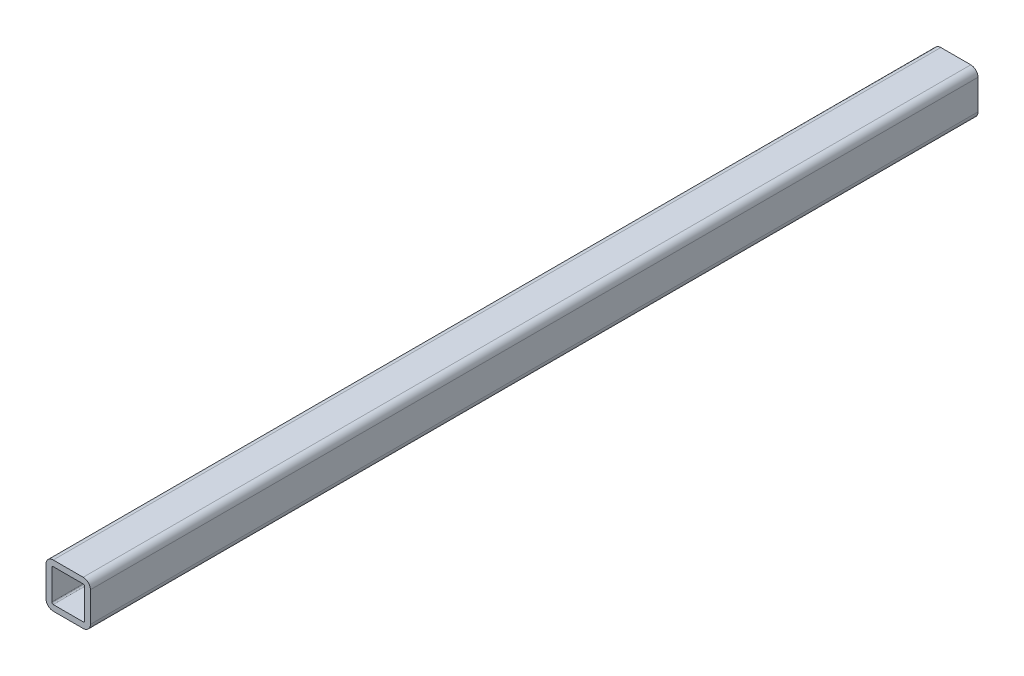
ISO-10303-21;
HEADER;
FILE_DESCRIPTION(('STEP AP214'),'2;1');
FILE_NAME('part.step','',(''),(''),'','','');
FILE_SCHEMA(('AUTOMOTIVE_DESIGN { 1 0 10303 214 1 1 1 1 }'));
ENDSEC;
DATA;
#1=APPLICATION_CONTEXT('core data for automotive mechanical design processes');
#2=APPLICATION_PROTOCOL_DEFINITION('international standard','automotive_design',2000,#1);
#3=PRODUCT_CONTEXT('',#1,'mechanical');
#4=PRODUCT('Part','Part','',(#3));
#5=PRODUCT_RELATED_PRODUCT_CATEGORY('part','',(#4));
#6=PRODUCT_DEFINITION_FORMATION('','',#4);
#7=PRODUCT_DEFINITION_CONTEXT('part definition',#1,'design');
#8=PRODUCT_DEFINITION('design','',#6,#7);
#9=PRODUCT_DEFINITION_SHAPE('','',#8);
#10=(LENGTH_UNIT() NAMED_UNIT(*) SI_UNIT(.MILLI.,.METRE.));
#11=(NAMED_UNIT(*) PLANE_ANGLE_UNIT() SI_UNIT($,.RADIAN.));
#12=(NAMED_UNIT(*) SI_UNIT($,.STERADIAN.) SOLID_ANGLE_UNIT());
#13=UNCERTAINTY_MEASURE_WITH_UNIT(LENGTH_MEASURE(1.E-05),#10,'distance_accuracy_value','');
#14=(GEOMETRIC_REPRESENTATION_CONTEXT(3) GLOBAL_UNCERTAINTY_ASSIGNED_CONTEXT((#13)) GLOBAL_UNIT_ASSIGNED_CONTEXT((#10,
#11,#12)) REPRESENTATION_CONTEXT('',''));
#15=CARTESIAN_POINT('',(0.,0.,0.));
#16=DIRECTION('',(0.,0.,1.));
#17=DIRECTION('',(1.,0.,0.));
#18=AXIS2_PLACEMENT_3D('',#15,#16,#17);
#19=CARTESIAN_POINT('',(4.28625000000001,-4.28625000000001,127.));
#20=DIRECTION('',(0.,0.,1.));
#21=DIRECTION('',(1.,0.,0.));
#22=AXIS2_PLACEMENT_3D('',#19,#20,#21);
#23=PLANE('',#22);
#24=CARTESIAN_POINT('',(4.28625000000001,-4.28625000000001,127.));
#25=DIRECTION('',(0.,0.,1.));
#26=DIRECTION('',(1.,0.,0.));
#27=AXIS2_PLACEMENT_3D('',#24,#25,#26);
#28=CIRCLE('',#27,2.06375);
#29=CARTESIAN_POINT('',(4.28625000000001,-6.35000000000001,127.));
#30=VERTEX_POINT('',#29);
#31=CARTESIAN_POINT('',(6.35000000000001,-4.28625000000001,127.));
#32=VERTEX_POINT('',#31);
#33=EDGE_CURVE('E247',#30,#32,#28,.T.);
#34=ORIENTED_EDGE('',*,*,#33,.T.);
#35=DIRECTION('',(0.,1.,0.));
#36=VECTOR('',#35,1.);
#37=CARTESIAN_POINT('',(6.35000000000001,-4.28625000000001,127.));
#38=LINE('',#37,#36);
#39=CARTESIAN_POINT('',(6.35000000000001,4.28625000000001,127.));
#40=VERTEX_POINT('',#39);
#41=EDGE_CURVE('E251',#32,#40,#38,.T.);
#42=ORIENTED_EDGE('',*,*,#41,.T.);
#43=CARTESIAN_POINT('',(4.28625000000001,4.28625000000001,127.));
#44=DIRECTION('',(0.,0.,1.));
#45=DIRECTION('',(1.,0.,0.));
#46=AXIS2_PLACEMENT_3D('',#43,#44,#45);
#47=CIRCLE('',#46,2.06375);
#48=CARTESIAN_POINT('',(4.28625000000001,6.35000000000001,127.));
#49=VERTEX_POINT('',#48);
#50=EDGE_CURVE('E255',#40,#49,#47,.T.);
#51=ORIENTED_EDGE('',*,*,#50,.T.);
#52=DIRECTION('',(-1.,0.,0.));
#53=VECTOR('',#52,1.);
#54=CARTESIAN_POINT('',(4.28625000000001,6.35000000000001,127.));
#55=LINE('',#54,#53);
#56=CARTESIAN_POINT('',(-4.28625000000001,6.35000000000001,127.));
#57=VERTEX_POINT('',#56);
#58=EDGE_CURVE('E258',#49,#57,#55,.T.);
#59=ORIENTED_EDGE('',*,*,#58,.T.);
#60=CARTESIAN_POINT('',(-4.28625000000001,4.28625000000001,127.));
#61=DIRECTION('',(0.,0.,1.));
#62=DIRECTION('',(1.,0.,0.));
#63=AXIS2_PLACEMENT_3D('',#60,#61,#62);
#64=CIRCLE('',#63,2.06375);
#65=CARTESIAN_POINT('',(-6.35000000000001,4.28625000000001,127.));
#66=VERTEX_POINT('',#65);
#67=EDGE_CURVE('E261',#57,#66,#64,.T.);
#68=ORIENTED_EDGE('',*,*,#67,.T.);
#69=DIRECTION('',(0.,-1.,0.));
#70=VECTOR('',#69,1.);
#71=CARTESIAN_POINT('',(-6.35000000000001,-4.28625000000001,127.));
#72=LINE('',#71,#70);
#73=CARTESIAN_POINT('',(-6.35000000000001,-4.28625000000001,127.));
#74=VERTEX_POINT('',#73);
#75=EDGE_CURVE('E264',#66,#74,#72,.T.);
#76=ORIENTED_EDGE('',*,*,#75,.T.);
#77=CARTESIAN_POINT('',(-4.28625000000001,-4.28625000000001,127.));
#78=DIRECTION('',(0.,0.,1.));
#79=DIRECTION('',(1.,0.,0.));
#80=AXIS2_PLACEMENT_3D('',#77,#78,#79);
#81=CIRCLE('',#80,2.06375);
#82=CARTESIAN_POINT('',(-4.28625000000001,-6.35000000000001,127.));
#83=VERTEX_POINT('',#82);
#84=EDGE_CURVE('E267',#74,#83,#81,.T.);
#85=ORIENTED_EDGE('',*,*,#84,.T.);
#86=DIRECTION('',(1.,0.,0.));
#87=VECTOR('',#86,1.);
#88=CARTESIAN_POINT('',(4.28625000000001,-6.35000000000001,127.));
#89=LINE('',#88,#87);
#90=EDGE_CURVE('E270',#83,#30,#89,.T.);
#91=ORIENTED_EDGE('',*,*,#90,.T.);
#92=EDGE_LOOP('',(#34,#42,#51,#59,#68,#76,#85,#91));
#93=FACE_BOUND('',#92,.T.);
#94=DIRECTION('',(-1.,0.,0.));
#95=VECTOR('',#94,1.);
#96=CARTESIAN_POINT('',(4.28625000000001,4.69900000000001,127.));
#97=LINE('',#96,#95);
#98=CARTESIAN_POINT('',(4.28625000000001,4.69900000000001,127.));
#99=VERTEX_POINT('',#98);
#100=CARTESIAN_POINT('',(-4.28625000000001,4.69900000000001,127.));
#101=VERTEX_POINT('',#100);
#102=EDGE_CURVE('E167',#99,#101,#97,.T.);
#103=ORIENTED_EDGE('',*,*,#102,.F.);
#104=CARTESIAN_POINT('',(4.28625000000001,4.28625000000001,127.));
#105=DIRECTION('',(0.,0.,1.));
#106=DIRECTION('',(1.,0.,0.));
#107=AXIS2_PLACEMENT_3D('',#104,#105,#106);
#108=CIRCLE('',#107,0.412750000000003);
#109=CARTESIAN_POINT('',(4.69900000000001,4.28625000000001,127.));
#110=VERTEX_POINT('',#109);
#111=EDGE_CURVE('E158',#110,#99,#108,.T.);
#112=ORIENTED_EDGE('',*,*,#111,.F.);
#113=DIRECTION('',(0.,1.,0.));
#114=VECTOR('',#113,1.);
#115=CARTESIAN_POINT('',(4.69900000000001,4.28625000000001,127.));
#116=LINE('',#115,#114);
#117=CARTESIAN_POINT('',(4.69900000000001,-4.28625000000001,127.));
#118=VERTEX_POINT('',#117);
#119=EDGE_CURVE('E199',#118,#110,#116,.T.);
#120=ORIENTED_EDGE('',*,*,#119,.F.);
#121=CARTESIAN_POINT('',(4.28625000000001,-4.28625000000001,127.));
#122=DIRECTION('',(0.,0.,1.));
#123=DIRECTION('',(1.,0.,0.));
#124=AXIS2_PLACEMENT_3D('',#121,#122,#123);
#125=CIRCLE('',#124,0.412750000000003);
#126=CARTESIAN_POINT('',(4.28625000000001,-4.69900000000001,127.));
#127=VERTEX_POINT('',#126);
#128=EDGE_CURVE('E196',#127,#118,#125,.T.);
#129=ORIENTED_EDGE('',*,*,#128,.F.);
#130=DIRECTION('',(1.,0.,0.));
#131=VECTOR('',#130,1.);
#132=CARTESIAN_POINT('',(4.28625000000001,-4.69900000000001,127.));
#133=LINE('',#132,#131);
#134=CARTESIAN_POINT('',(-4.28625000000001,-4.69900000000001,127.));
#135=VERTEX_POINT('',#134);
#136=EDGE_CURVE('E193',#135,#127,#133,.T.);
#137=ORIENTED_EDGE('',*,*,#136,.F.);
#138=CARTESIAN_POINT('',(-4.28625000000001,-4.28625000000001,127.));
#139=DIRECTION('',(0.,0.,1.));
#140=DIRECTION('',(1.,0.,0.));
#141=AXIS2_PLACEMENT_3D('',#138,#139,#140);
#142=CIRCLE('',#141,0.412750000000003);
#143=CARTESIAN_POINT('',(-4.69900000000001,-4.28625000000001,127.));
#144=VERTEX_POINT('',#143);
#145=EDGE_CURVE('E190',#144,#135,#142,.T.);
#146=ORIENTED_EDGE('',*,*,#145,.F.);
#147=DIRECTION('',(0.,-1.,0.));
#148=VECTOR('',#147,1.);
#149=CARTESIAN_POINT('',(-4.69900000000001,4.28625000000001,127.));
#150=LINE('',#149,#148);
#151=CARTESIAN_POINT('',(-4.69900000000001,4.28625000000001,127.));
#152=VERTEX_POINT('',#151);
#153=EDGE_CURVE('E185',#152,#144,#150,.T.);
#154=ORIENTED_EDGE('',*,*,#153,.F.);
#155=CARTESIAN_POINT('',(-4.28625000000001,4.28625000000001,127.));
#156=DIRECTION('',(0.,0.,1.));
#157=DIRECTION('',(1.,0.,0.));
#158=AXIS2_PLACEMENT_3D('',#155,#156,#157);
#159=CIRCLE('',#158,0.412750000000003);
#160=EDGE_CURVE('E181',#101,#152,#159,.T.);
#161=ORIENTED_EDGE('',*,*,#160,.F.);
#162=EDGE_LOOP('',(#103,#112,#120,#129,#137,#146,#154,#161));
#163=FACE_BOUND('',#162,.T.);
#164=ADVANCED_FACE('F44',(#93,#163),#23,.T.);
#165=CARTESIAN_POINT('',(4.28625000000001,-4.28625000000001,-127.));
#166=DIRECTION('',(0.,0.,1.));
#167=DIRECTION('',(1.,0.,0.));
#168=AXIS2_PLACEMENT_3D('',#165,#166,#167);
#169=PLANE('',#168);
#170=CARTESIAN_POINT('',(4.28625000000001,-4.28625000000001,-127.));
#171=DIRECTION('',(0.,0.,1.));
#172=DIRECTION('',(1.,0.,0.));
#173=AXIS2_PLACEMENT_3D('',#170,#171,#172);
#174=CIRCLE('',#173,2.06375);
#175=CARTESIAN_POINT('',(4.28625000000001,-6.35000000000001,-127.));
#176=VERTEX_POINT('',#175);
#177=CARTESIAN_POINT('',(6.35000000000001,-4.28625000000001,-127.));
#178=VERTEX_POINT('',#177);
#179=EDGE_CURVE('E176',#176,#178,#174,.T.);
#180=ORIENTED_EDGE('',*,*,#179,.F.);
#181=DIRECTION('',(1.,0.,0.));
#182=VECTOR('',#181,1.);
#183=CARTESIAN_POINT('',(4.28625000000001,-6.35000000000001,-127.));
#184=LINE('',#183,#182);
#185=CARTESIAN_POINT('',(-4.28625000000001,-6.35000000000001,-127.));
#186=VERTEX_POINT('',#185);
#187=EDGE_CURVE('E252',#186,#176,#184,.T.);
#188=ORIENTED_EDGE('',*,*,#187,.F.);
#189=CARTESIAN_POINT('',(-4.28625000000001,-4.28625000000001,-127.));
#190=DIRECTION('',(0.,0.,1.));
#191=DIRECTION('',(1.,0.,0.));
#192=AXIS2_PLACEMENT_3D('',#189,#190,#191);
#193=CIRCLE('',#192,2.06375);
#194=CARTESIAN_POINT('',(-6.35000000000001,-4.28625000000001,-127.));
#195=VERTEX_POINT('',#194);
#196=EDGE_CURVE('E292',#195,#186,#193,.T.);
#197=ORIENTED_EDGE('',*,*,#196,.F.);
#198=DIRECTION('',(0.,-1.,0.));
#199=VECTOR('',#198,1.);
#200=CARTESIAN_POINT('',(-6.35000000000001,-4.28625000000001,-127.));
#201=LINE('',#200,#199);
#202=CARTESIAN_POINT('',(-6.35000000000001,4.28625000000001,-127.));
#203=VERTEX_POINT('',#202);
#204=EDGE_CURVE('E289',#203,#195,#201,.T.);
#205=ORIENTED_EDGE('',*,*,#204,.F.);
#206=CARTESIAN_POINT('',(-4.28625000000001,4.28625000000001,-127.));
#207=DIRECTION('',(0.,0.,1.));
#208=DIRECTION('',(1.,0.,0.));
#209=AXIS2_PLACEMENT_3D('',#206,#207,#208);
#210=CIRCLE('',#209,2.06375);
#211=CARTESIAN_POINT('',(-4.28625000000001,6.35000000000001,-127.));
#212=VERTEX_POINT('',#211);
#213=EDGE_CURVE('E286',#212,#203,#210,.T.);
#214=ORIENTED_EDGE('',*,*,#213,.F.);
#215=DIRECTION('',(-1.,0.,0.));
#216=VECTOR('',#215,1.);
#217=CARTESIAN_POINT('',(4.28625000000001,6.35000000000001,-127.));
#218=LINE('',#217,#216);
#219=CARTESIAN_POINT('',(4.28625000000001,6.35000000000001,-127.));
#220=VERTEX_POINT('',#219);
#221=EDGE_CURVE('E283',#220,#212,#218,.T.);
#222=ORIENTED_EDGE('',*,*,#221,.F.);
#223=CARTESIAN_POINT('',(4.28625000000001,4.28625000000001,-127.));
#224=DIRECTION('',(0.,0.,1.));
#225=DIRECTION('',(1.,0.,0.));
#226=AXIS2_PLACEMENT_3D('',#223,#224,#225);
#227=CIRCLE('',#226,2.06375);
#228=CARTESIAN_POINT('',(6.35000000000001,4.28625000000001,-127.));
#229=VERTEX_POINT('',#228);
#230=EDGE_CURVE('E280',#229,#220,#227,.T.);
#231=ORIENTED_EDGE('',*,*,#230,.F.);
#232=DIRECTION('',(0.,1.,0.));
#233=VECTOR('',#232,1.);
#234=CARTESIAN_POINT('',(6.35000000000001,-4.28625000000001,-127.));
#235=LINE('',#234,#233);
#236=EDGE_CURVE('E277',#178,#229,#235,.T.);
#237=ORIENTED_EDGE('',*,*,#236,.F.);
#238=EDGE_LOOP('',(#180,#188,#197,#205,#214,#222,#231,#237));
#239=FACE_BOUND('',#238,.T.);
#240=CARTESIAN_POINT('',(4.28625000000001,4.28625000000001,-127.));
#241=DIRECTION('',(0.,0.,1.));
#242=DIRECTION('',(1.,0.,0.));
#243=AXIS2_PLACEMENT_3D('',#240,#241,#242);
#244=CIRCLE('',#243,0.412750000000003);
#245=CARTESIAN_POINT('',(4.69900000000001,4.28625000000001,-127.));
#246=VERTEX_POINT('',#245);
#247=CARTESIAN_POINT('',(4.28625000000001,4.69900000000001,-127.));
#248=VERTEX_POINT('',#247);
#249=EDGE_CURVE('E68',#246,#248,#244,.T.);
#250=ORIENTED_EDGE('',*,*,#249,.T.);
#251=DIRECTION('',(-1.,0.,0.));
#252=VECTOR('',#251,1.);
#253=CARTESIAN_POINT('',(4.28625000000001,4.69900000000001,-127.));
#254=LINE('',#253,#252);
#255=CARTESIAN_POINT('',(-4.28625000000001,4.69900000000001,-127.));
#256=VERTEX_POINT('',#255);
#257=EDGE_CURVE('E174',#248,#256,#254,.T.);
#258=ORIENTED_EDGE('',*,*,#257,.T.);
#259=CARTESIAN_POINT('',(-4.28625000000001,4.28625000000001,-127.));
#260=DIRECTION('',(0.,0.,1.));
#261=DIRECTION('',(1.,0.,0.));
#262=AXIS2_PLACEMENT_3D('',#259,#260,#261);
#263=CIRCLE('',#262,0.412750000000003);
#264=CARTESIAN_POINT('',(-4.69900000000001,4.28625000000001,-127.));
#265=VERTEX_POINT('',#264);
#266=EDGE_CURVE('E206',#256,#265,#263,.T.);
#267=ORIENTED_EDGE('',*,*,#266,.T.);
#268=DIRECTION('',(0.,-1.,0.));
#269=VECTOR('',#268,1.);
#270=CARTESIAN_POINT('',(-4.69900000000001,4.28625000000001,-127.));
#271=LINE('',#270,#269);
#272=CARTESIAN_POINT('',(-4.69900000000001,-4.28625000000001,-127.));
#273=VERTEX_POINT('',#272);
#274=EDGE_CURVE('E210',#265,#273,#271,.T.);
#275=ORIENTED_EDGE('',*,*,#274,.T.);
#276=CARTESIAN_POINT('',(-4.28625000000001,-4.28625000000001,-127.));
#277=DIRECTION('',(0.,0.,1.));
#278=DIRECTION('',(1.,0.,0.));
#279=AXIS2_PLACEMENT_3D('',#276,#277,#278);
#280=CIRCLE('',#279,0.412750000000003);
#281=CARTESIAN_POINT('',(-4.28625000000001,-4.69900000000001,-127.));
#282=VERTEX_POINT('',#281);
#283=EDGE_CURVE('E214',#273,#282,#280,.T.);
#284=ORIENTED_EDGE('',*,*,#283,.T.);
#285=DIRECTION('',(1.,0.,0.));
#286=VECTOR('',#285,1.);
#287=CARTESIAN_POINT('',(4.28625000000001,-4.69900000000001,-127.));
#288=LINE('',#287,#286);
#289=CARTESIAN_POINT('',(4.28625000000001,-4.69900000000001,-127.));
#290=VERTEX_POINT('',#289);
#291=EDGE_CURVE('E218',#282,#290,#288,.T.);
#292=ORIENTED_EDGE('',*,*,#291,.T.);
#293=CARTESIAN_POINT('',(4.28625000000001,-4.28625000000001,-127.));
#294=DIRECTION('',(0.,0.,1.));
#295=DIRECTION('',(1.,0.,0.));
#296=AXIS2_PLACEMENT_3D('',#293,#294,#295);
#297=CIRCLE('',#296,0.412750000000003);
#298=CARTESIAN_POINT('',(4.69900000000001,-4.28625000000001,-127.));
#299=VERTEX_POINT('',#298);
#300=EDGE_CURVE('E222',#290,#299,#297,.T.);
#301=ORIENTED_EDGE('',*,*,#300,.T.);
#302=DIRECTION('',(0.,1.,0.));
#303=VECTOR('',#302,1.);
#304=CARTESIAN_POINT('',(4.69900000000001,4.28625000000001,-127.));
#305=LINE('',#304,#303);
#306=EDGE_CURVE('E168',#299,#246,#305,.T.);
#307=ORIENTED_EDGE('',*,*,#306,.T.);
#308=EDGE_LOOP('',(#250,#258,#267,#275,#284,#292,#301,#307));
#309=FACE_BOUND('',#308,.T.);
#310=ADVANCED_FACE('F331',(#239,#309),#169,.F.);
#311=CARTESIAN_POINT('',(4.28625000000001,-4.28625000000001,127.));
#312=DIRECTION('',(0.,0.,-1.));
#313=DIRECTION('',(-1.,0.,0.));
#314=AXIS2_PLACEMENT_3D('',#311,#312,#313);
#315=CYLINDRICAL_SURFACE('',#314,2.06375);
#316=ORIENTED_EDGE('',*,*,#179,.T.);
#317=DIRECTION('',(0.,0.,-1.));
#318=VECTOR('',#317,1.);
#319=CARTESIAN_POINT('',(6.35000000000001,-4.28625000000001,127.));
#320=LINE('',#319,#318);
#321=EDGE_CURVE('E11',#32,#178,#320,.T.);
#322=ORIENTED_EDGE('',*,*,#321,.F.);
#323=ORIENTED_EDGE('',*,*,#33,.F.);
#324=DIRECTION('',(0.,0.,-1.));
#325=VECTOR('',#324,1.);
#326=CARTESIAN_POINT('',(4.28625000000001,-6.35000000000001,127.));
#327=LINE('',#326,#325);
#328=EDGE_CURVE('E273',#30,#176,#327,.T.);
#329=ORIENTED_EDGE('',*,*,#328,.T.);
#330=EDGE_LOOP('',(#316,#322,#323,#329));
#331=FACE_BOUND('',#330,.T.);
#332=ADVANCED_FACE('F46',(#331),#315,.T.);
#333=CARTESIAN_POINT('',(6.35000000000001,-4.28625000000001,127.));
#334=DIRECTION('',(-1.,0.,0.));
#335=DIRECTION('',(0.,0.,1.));
#336=AXIS2_PLACEMENT_3D('',#333,#334,#335);
#337=PLANE('',#336);
#338=ORIENTED_EDGE('',*,*,#236,.T.);
#339=DIRECTION('',(0.,0.,-1.));
#340=VECTOR('',#339,1.);
#341=CARTESIAN_POINT('',(6.35000000000001,4.28625000000001,127.));
#342=LINE('',#341,#340);
#343=EDGE_CURVE('E53',#40,#229,#342,.T.);
#344=ORIENTED_EDGE('',*,*,#343,.F.);
#345=ORIENTED_EDGE('',*,*,#41,.F.);
#346=ORIENTED_EDGE('',*,*,#321,.T.);
#347=EDGE_LOOP('',(#338,#344,#345,#346));
#348=FACE_BOUND('',#347,.T.);
#349=ADVANCED_FACE('F348',(#348),#337,.F.);
#350=CARTESIAN_POINT('',(4.28625000000001,4.28625000000001,127.));
#351=DIRECTION('',(0.,0.,-1.));
#352=DIRECTION('',(-1.,0.,0.));
#353=AXIS2_PLACEMENT_3D('',#350,#351,#352);
#354=CYLINDRICAL_SURFACE('',#353,2.06375);
#355=ORIENTED_EDGE('',*,*,#230,.T.);
#356=DIRECTION('',(0.,0.,-1.));
#357=VECTOR('',#356,1.);
#358=CARTESIAN_POINT('',(4.28625000000001,6.35000000000001,127.));
#359=LINE('',#358,#357);
#360=EDGE_CURVE('E316',#49,#220,#359,.T.);
#361=ORIENTED_EDGE('',*,*,#360,.F.);
#362=ORIENTED_EDGE('',*,*,#50,.F.);
#363=ORIENTED_EDGE('',*,*,#343,.T.);
#364=EDGE_LOOP('',(#355,#361,#362,#363));
#365=FACE_BOUND('',#364,.T.);
#366=ADVANCED_FACE('F325',(#365),#354,.T.);
#367=CARTESIAN_POINT('',(4.28625000000001,6.35000000000001,127.));
#368=DIRECTION('',(0.,-1.,0.));
#369=DIRECTION('',(0.,0.,-1.));
#370=AXIS2_PLACEMENT_3D('',#367,#368,#369);
#371=PLANE('',#370);
#372=ORIENTED_EDGE('',*,*,#221,.T.);
#373=DIRECTION('',(0.,0.,-1.));
#374=VECTOR('',#373,1.);
#375=CARTESIAN_POINT('',(-4.28625000000001,6.35000000000001,127.));
#376=LINE('',#375,#374);
#377=EDGE_CURVE('E312',#57,#212,#376,.T.);
#378=ORIENTED_EDGE('',*,*,#377,.F.);
#379=ORIENTED_EDGE('',*,*,#58,.F.);
#380=ORIENTED_EDGE('',*,*,#360,.T.);
#381=EDGE_LOOP('',(#372,#378,#379,#380));
#382=FACE_BOUND('',#381,.T.);
#383=ADVANCED_FACE('F337',(#382),#371,.F.);
#384=CARTESIAN_POINT('',(-4.28625000000001,4.28625000000001,127.));
#385=DIRECTION('',(0.,0.,-1.));
#386=DIRECTION('',(-1.,0.,0.));
#387=AXIS2_PLACEMENT_3D('',#384,#385,#386);
#388=CYLINDRICAL_SURFACE('',#387,2.06375);
#389=ORIENTED_EDGE('',*,*,#213,.T.);
#390=DIRECTION('',(0.,0.,-1.));
#391=VECTOR('',#390,1.);
#392=CARTESIAN_POINT('',(-6.35000000000001,4.28625000000001,127.));
#393=LINE('',#392,#391);
#394=EDGE_CURVE('E308',#66,#203,#393,.T.);
#395=ORIENTED_EDGE('',*,*,#394,.F.);
#396=ORIENTED_EDGE('',*,*,#67,.F.);
#397=ORIENTED_EDGE('',*,*,#377,.T.);
#398=EDGE_LOOP('',(#389,#395,#396,#397));
#399=FACE_BOUND('',#398,.T.);
#400=ADVANCED_FACE('F341',(#399),#388,.T.);
#401=CARTESIAN_POINT('',(-6.35000000000001,-4.28625000000001,127.));
#402=DIRECTION('',(1.,0.,0.));
#403=DIRECTION('',(0.,0.,-1.));
#404=AXIS2_PLACEMENT_3D('',#401,#402,#403);
#405=PLANE('',#404);
#406=ORIENTED_EDGE('',*,*,#204,.T.);
#407=DIRECTION('',(0.,0.,-1.));
#408=VECTOR('',#407,1.);
#409=CARTESIAN_POINT('',(-6.35000000000001,-4.28625000000001,127.));
#410=LINE('',#409,#408);
#411=EDGE_CURVE('E304',#74,#195,#410,.T.);
#412=ORIENTED_EDGE('',*,*,#411,.F.);
#413=ORIENTED_EDGE('',*,*,#75,.F.);
#414=ORIENTED_EDGE('',*,*,#394,.T.);
#415=EDGE_LOOP('',(#406,#412,#413,#414));
#416=FACE_BOUND('',#415,.T.);
#417=ADVANCED_FACE('F361',(#416),#405,.F.);
#418=CARTESIAN_POINT('',(-4.28625000000001,-4.28625000000001,127.));
#419=DIRECTION('',(0.,0.,-1.));
#420=DIRECTION('',(-1.,0.,0.));
#421=AXIS2_PLACEMENT_3D('',#418,#419,#420);
#422=CYLINDRICAL_SURFACE('',#421,2.06375);
#423=ORIENTED_EDGE('',*,*,#196,.T.);
#424=DIRECTION('',(0.,0.,-1.));
#425=VECTOR('',#424,1.);
#426=CARTESIAN_POINT('',(-4.28625000000001,-6.35000000000001,127.));
#427=LINE('',#426,#425);
#428=EDGE_CURVE('E300',#83,#186,#427,.T.);
#429=ORIENTED_EDGE('',*,*,#428,.F.);
#430=ORIENTED_EDGE('',*,*,#84,.F.);
#431=ORIENTED_EDGE('',*,*,#411,.T.);
#432=EDGE_LOOP('',(#423,#429,#430,#431));
#433=FACE_BOUND('',#432,.T.);
#434=ADVANCED_FACE('F359',(#433),#422,.T.);
#435=CARTESIAN_POINT('',(4.28625000000001,-6.35000000000001,127.));
#436=DIRECTION('',(0.,1.,0.));
#437=DIRECTION('',(0.,0.,1.));
#438=AXIS2_PLACEMENT_3D('',#435,#436,#437);
#439=PLANE('',#438);
#440=ORIENTED_EDGE('',*,*,#187,.T.);
#441=ORIENTED_EDGE('',*,*,#328,.F.);
#442=ORIENTED_EDGE('',*,*,#90,.F.);
#443=ORIENTED_EDGE('',*,*,#428,.T.);
#444=EDGE_LOOP('',(#440,#441,#442,#443));
#445=FACE_BOUND('',#444,.T.);
#446=ADVANCED_FACE('F354',(#445),#439,.F.);
#447=CARTESIAN_POINT('',(4.28625000000001,4.28625000000001,127.));
#448=DIRECTION('',(0.,0.,-1.));
#449=DIRECTION('',(-1.,0.,0.));
#450=AXIS2_PLACEMENT_3D('',#447,#448,#449);
#451=CYLINDRICAL_SURFACE('',#450,0.412750000000003);
#452=ORIENTED_EDGE('',*,*,#249,.F.);
#453=DIRECTION('',(0.,0.,-1.));
#454=VECTOR('',#453,1.);
#455=CARTESIAN_POINT('',(4.69900000000001,4.28625000000001,127.));
#456=LINE('',#455,#454);
#457=EDGE_CURVE('E162',#110,#246,#456,.T.);
#458=ORIENTED_EDGE('',*,*,#457,.F.);
#459=ORIENTED_EDGE('',*,*,#111,.T.);
#460=DIRECTION('',(0.,0.,-1.));
#461=VECTOR('',#460,1.);
#462=CARTESIAN_POINT('',(4.28625000000001,4.69900000000001,127.));
#463=LINE('',#462,#461);
#464=EDGE_CURVE('E161',#99,#248,#463,.T.);
#465=ORIENTED_EDGE('',*,*,#464,.T.);
#466=EDGE_LOOP('',(#452,#458,#459,#465));
#467=FACE_BOUND('',#466,.T.);
#468=ADVANCED_FACE('F160',(#467),#451,.F.);
#469=CARTESIAN_POINT('',(4.28625000000001,4.69900000000001,127.));
#470=DIRECTION('',(0.,-1.,0.));
#471=DIRECTION('',(0.,0.,-1.));
#472=AXIS2_PLACEMENT_3D('',#469,#470,#471);
#473=PLANE('',#472);
#474=ORIENTED_EDGE('',*,*,#257,.F.);
#475=ORIENTED_EDGE('',*,*,#464,.F.);
#476=ORIENTED_EDGE('',*,*,#102,.T.);
#477=DIRECTION('',(0.,0.,-1.));
#478=VECTOR('',#477,1.);
#479=CARTESIAN_POINT('',(-4.28625000000001,4.69900000000001,127.));
#480=LINE('',#479,#478);
#481=EDGE_CURVE('E177',#101,#256,#480,.T.);
#482=ORIENTED_EDGE('',*,*,#481,.T.);
#483=EDGE_LOOP('',(#474,#475,#476,#482));
#484=FACE_BOUND('',#483,.T.);
#485=ADVANCED_FACE('F171',(#484),#473,.T.);
#486=CARTESIAN_POINT('',(-4.28625000000001,4.28625000000001,127.));
#487=DIRECTION('',(0.,0.,-1.));
#488=DIRECTION('',(-1.,0.,0.));
#489=AXIS2_PLACEMENT_3D('',#486,#487,#488);
#490=CYLINDRICAL_SURFACE('',#489,0.412750000000003);
#491=ORIENTED_EDGE('',*,*,#266,.F.);
#492=ORIENTED_EDGE('',*,*,#481,.F.);
#493=ORIENTED_EDGE('',*,*,#160,.T.);
#494=DIRECTION('',(0.,0.,-1.));
#495=VECTOR('',#494,1.);
#496=CARTESIAN_POINT('',(-4.69900000000001,4.28625000000001,127.));
#497=LINE('',#496,#495);
#498=EDGE_CURVE('E242',#152,#265,#497,.T.);
#499=ORIENTED_EDGE('',*,*,#498,.T.);
#500=EDGE_LOOP('',(#491,#492,#493,#499));
#501=FACE_BOUND('',#500,.T.);
#502=ADVANCED_FACE('F386',(#501),#490,.F.);
#503=CARTESIAN_POINT('',(-4.69900000000001,4.28625000000001,127.));
#504=DIRECTION('',(1.,0.,0.));
#505=DIRECTION('',(0.,0.,-1.));
#506=AXIS2_PLACEMENT_3D('',#503,#504,#505);
#507=PLANE('',#506);
#508=ORIENTED_EDGE('',*,*,#274,.F.);
#509=ORIENTED_EDGE('',*,*,#498,.F.);
#510=ORIENTED_EDGE('',*,*,#153,.T.);
#511=DIRECTION('',(0.,0.,-1.));
#512=VECTOR('',#511,1.);
#513=CARTESIAN_POINT('',(-4.69900000000001,-4.28625000000001,127.));
#514=LINE('',#513,#512);
#515=EDGE_CURVE('E239',#144,#273,#514,.T.);
#516=ORIENTED_EDGE('',*,*,#515,.T.);
#517=EDGE_LOOP('',(#508,#509,#510,#516));
#518=FACE_BOUND('',#517,.T.);
#519=ADVANCED_FACE('F390',(#518),#507,.T.);
#520=CARTESIAN_POINT('',(-4.28625000000001,-4.28625000000001,127.));
#521=DIRECTION('',(0.,0.,-1.));
#522=DIRECTION('',(-1.,0.,0.));
#523=AXIS2_PLACEMENT_3D('',#520,#521,#522);
#524=CYLINDRICAL_SURFACE('',#523,0.412750000000003);
#525=ORIENTED_EDGE('',*,*,#283,.F.);
#526=ORIENTED_EDGE('',*,*,#515,.F.);
#527=ORIENTED_EDGE('',*,*,#145,.T.);
#528=DIRECTION('',(0.,0.,-1.));
#529=VECTOR('',#528,1.);
#530=CARTESIAN_POINT('',(-4.28625000000001,-4.69900000000001,127.));
#531=LINE('',#530,#529);
#532=EDGE_CURVE('E236',#135,#282,#531,.T.);
#533=ORIENTED_EDGE('',*,*,#532,.T.);
#534=EDGE_LOOP('',(#525,#526,#527,#533));
#535=FACE_BOUND('',#534,.T.);
#536=ADVANCED_FACE('F396',(#535),#524,.F.);
#537=CARTESIAN_POINT('',(4.28625000000001,-4.69900000000001,127.));
#538=DIRECTION('',(0.,1.,0.));
#539=DIRECTION('',(0.,0.,1.));
#540=AXIS2_PLACEMENT_3D('',#537,#538,#539);
#541=PLANE('',#540);
#542=ORIENTED_EDGE('',*,*,#291,.F.);
#543=ORIENTED_EDGE('',*,*,#532,.F.);
#544=ORIENTED_EDGE('',*,*,#136,.T.);
#545=DIRECTION('',(0.,0.,-1.));
#546=VECTOR('',#545,1.);
#547=CARTESIAN_POINT('',(4.28625000000001,-4.69900000000001,127.));
#548=LINE('',#547,#546);
#549=EDGE_CURVE('E233',#127,#290,#548,.T.);
#550=ORIENTED_EDGE('',*,*,#549,.T.);
#551=EDGE_LOOP('',(#542,#543,#544,#550));
#552=FACE_BOUND('',#551,.T.);
#553=ADVANCED_FACE('F400',(#552),#541,.T.);
#554=CARTESIAN_POINT('',(4.28625000000001,-4.28625000000001,127.));
#555=DIRECTION('',(0.,0.,-1.));
#556=DIRECTION('',(-1.,0.,0.));
#557=AXIS2_PLACEMENT_3D('',#554,#555,#556);
#558=CYLINDRICAL_SURFACE('',#557,0.412750000000003);
#559=ORIENTED_EDGE('',*,*,#300,.F.);
#560=ORIENTED_EDGE('',*,*,#549,.F.);
#561=ORIENTED_EDGE('',*,*,#128,.T.);
#562=DIRECTION('',(0.,0.,-1.));
#563=VECTOR('',#562,1.);
#564=CARTESIAN_POINT('',(4.69900000000001,-4.28625000000001,127.));
#565=LINE('',#564,#563);
#566=EDGE_CURVE('E60',#118,#299,#565,.T.);
#567=ORIENTED_EDGE('',*,*,#566,.T.);
#568=EDGE_LOOP('',(#559,#560,#561,#567));
#569=FACE_BOUND('',#568,.T.);
#570=ADVANCED_FACE('F404',(#569),#558,.F.);
#571=CARTESIAN_POINT('',(4.69900000000001,4.28625000000001,127.));
#572=DIRECTION('',(-1.,0.,0.));
#573=DIRECTION('',(0.,0.,1.));
#574=AXIS2_PLACEMENT_3D('',#571,#572,#573);
#575=PLANE('',#574);
#576=ORIENTED_EDGE('',*,*,#306,.F.);
#577=ORIENTED_EDGE('',*,*,#566,.F.);
#578=ORIENTED_EDGE('',*,*,#119,.T.);
#579=ORIENTED_EDGE('',*,*,#457,.T.);
#580=EDGE_LOOP('',(#576,#577,#578,#579));
#581=FACE_BOUND('',#580,.T.);
#582=ADVANCED_FACE('F408',(#581),#575,.T.);
#583=CLOSED_SHELL('',(#164,#310,#332,#349,#366,#383,#400,#417,#434,#446,#468,#485,#502,#519,
#536,#553,#570,#582));
#584=MANIFOLD_SOLID_BREP('B2',#583);
#585=ADVANCED_BREP_SHAPE_REPRESENTATION('',(#18,#584),#14);
#586=SHAPE_DEFINITION_REPRESENTATION(#9,#585);
ENDSEC;
END-ISO-10303-21;
